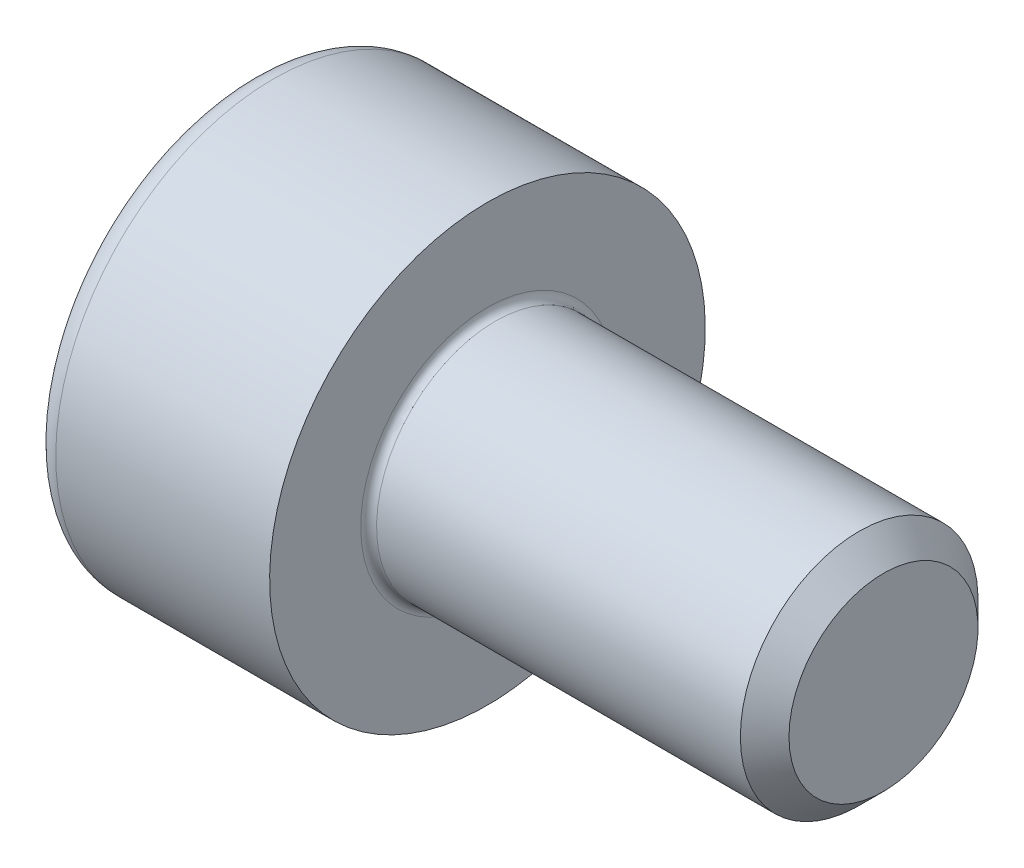
ISO-10303-21;
HEADER;
FILE_DESCRIPTION(('STEP AP214'),'2;1');
FILE_NAME('part.step','',(''),(''),'','','');
FILE_SCHEMA(('AUTOMOTIVE_DESIGN { 1 0 10303 214 1 1 1 1 }'));
ENDSEC;
DATA;
#1=APPLICATION_CONTEXT('core data for automotive mechanical design processes');
#2=APPLICATION_PROTOCOL_DEFINITION('international standard','automotive_design',2000,#1);
#3=PRODUCT_CONTEXT('',#1,'mechanical');
#4=PRODUCT('Part','Part','',(#3));
#5=PRODUCT_RELATED_PRODUCT_CATEGORY('part','',(#4));
#6=PRODUCT_DEFINITION_FORMATION('','',#4);
#7=PRODUCT_DEFINITION_CONTEXT('part definition',#1,'design');
#8=PRODUCT_DEFINITION('design','',#6,#7);
#9=PRODUCT_DEFINITION_SHAPE('','',#8);
#10=(LENGTH_UNIT() NAMED_UNIT(*) SI_UNIT(.MILLI.,.METRE.));
#11=(NAMED_UNIT(*) PLANE_ANGLE_UNIT() SI_UNIT($,.RADIAN.));
#12=(NAMED_UNIT(*) SI_UNIT($,.STERADIAN.) SOLID_ANGLE_UNIT());
#13=UNCERTAINTY_MEASURE_WITH_UNIT(LENGTH_MEASURE(1.E-05),#10,'distance_accuracy_value','');
#14=(GEOMETRIC_REPRESENTATION_CONTEXT(3) GLOBAL_UNCERTAINTY_ASSIGNED_CONTEXT((#13)) GLOBAL_UNIT_ASSIGNED_CONTEXT((#10,
#11,#12)) REPRESENTATION_CONTEXT('',''));
#15=CARTESIAN_POINT('',(0.,0.,0.));
#16=DIRECTION('',(0.,0.,1.));
#17=DIRECTION('',(1.,0.,0.));
#18=AXIS2_PLACEMENT_3D('',#15,#16,#17);
#19=CARTESIAN_POINT('',(5.,0.749999999999999,0.));
#20=DIRECTION('',(1.,0.,0.));
#21=DIRECTION('',(0.,1.,0.));
#22=AXIS2_PLACEMENT_3D('',#19,#20,#21);
#23=PLANE('',#22);
#24=CARTESIAN_POINT('',(4.99999999999545,0.,0.));
#25=DIRECTION('',(-1.,0.,0.));
#26=DIRECTION('',(0.,0.,1.));
#27=AXIS2_PLACEMENT_3D('',#24,#25,#26);
#28=CIRCLE('',#27,1.19327500004829);
#29=CARTESIAN_POINT('',(4.99999999999545,0.,1.19327500004829));
#30=VERTEX_POINT('',#29);
#31=EDGE_CURVE('E20',#30,#30,#28,.T.);
#32=ORIENTED_EDGE('',*,*,#31,.F.);
#33=EDGE_LOOP('',(#32));
#34=FACE_BOUND('',#33,.T.);
#35=ADVANCED_FACE('F17',(#34),#23,.T.);
#36=CARTESIAN_POINT('',(4.69327500002237,0.,0.));
#37=DIRECTION('',(-1.,0.,0.));
#38=DIRECTION('',(0.,0.,1.));
#39=AXIS2_PLACEMENT_3D('',#36,#37,#38);
#40=CONICAL_SURFACE('',#39,1.50000000002137,0.785398163397448);
#41=ORIENTED_EDGE('',*,*,#31,.T.);
#42=EDGE_LOOP('',(#41));
#43=FACE_BOUND('',#42,.T.);
#44=CARTESIAN_POINT('',(4.693275,0.,0.));
#45=DIRECTION('',(1.,0.,0.));
#46=DIRECTION('',(0.,1.,0.));
#47=AXIS2_PLACEMENT_3D('',#44,#45,#46);
#48=CIRCLE('',#47,1.5);
#49=CARTESIAN_POINT('',(4.693275,1.5,0.));
#50=VERTEX_POINT('',#49);
#51=EDGE_CURVE('E86',#50,#50,#48,.F.);
#52=ORIENTED_EDGE('',*,*,#51,.F.);
#53=EDGE_LOOP('',(#52));
#54=FACE_BOUND('',#53,.T.);
#55=ADVANCED_FACE('F76',(#43,#54),#40,.T.);
#56=CARTESIAN_POINT('',(-1.70499999995855,0.,0.));
#57=DIRECTION('',(-1.,0.,0.));
#58=DIRECTION('',(0.,0.,1.));
#59=AXIS2_PLACEMENT_3D('',#56,#57,#58);
#60=CONICAL_SURFACE('',#59,1.45203592694543,1.04719755110347);
#61=CARTESIAN_POINT('',(-0.866666666638594,-5.6843418860808E-11,0.));
#62=VERTEX_POINT('',#61);
#63=VERTEX_LOOP('',#62);
#64=FACE_BOUND('',#63,.T.);
#65=CARTESIAN_POINT('',(-1.69999999999617,1.25,0.721687836488135));
#66=CARTESIAN_POINT('',(-1.68168471569602,1.25,0.658260217058125));
#67=CARTESIAN_POINT('',(-1.66502792317553,1.25,0.594285091319299));
#68=CARTESIAN_POINT('',(-1.63595399210618,1.25,0.46522715333314));
#69=CARTESIAN_POINT('',(-1.62354713768941,1.25,0.400142048722467));
#70=CARTESIAN_POINT('',(-1.60423497431521,1.25,0.270778406576447));
#71=CARTESIAN_POINT('',(-1.5972011172206,1.25,0.206519767719932));
#72=CARTESIAN_POINT('',(-1.58880573005285,1.25,0.0777002896263008));
#73=CARTESIAN_POINT('',(-1.58743724620536,1.25,0.0131399182916871));
#74=CARTESIAN_POINT('',(-1.5902914313199,1.25,-0.107484209674466));
#75=CARTESIAN_POINT('',(-1.59381330323442,1.25,-0.163566066939126));
#76=CARTESIAN_POINT('',(-1.60497331292594,1.25,-0.275364426461755));
#77=CARTESIAN_POINT('',(-1.61261525920924,1.25,-0.331080542327663));
#78=CARTESIAN_POINT('',(-1.63171864581936,1.25,-0.443109217014378));
#79=CARTESIAN_POINT('',(-1.64326102637173,1.25,-0.499407604247212));
#80=CARTESIAN_POINT('',(-1.66945735051506,1.25,-0.611164931125642));
#81=CARTESIAN_POINT('',(-1.68410514296338,1.25,-0.66662530140732));
#82=CARTESIAN_POINT('',(-1.69999999999617,1.25,-0.721687836488137));
#83=B_SPLINE_CURVE_WITH_KNOTS('',3,(#65,#66,#67,#68,#69,#70,#71,#72,#73,#74,#75,#76,#77,#78,#79,
#80,#81,#82),.UNSPECIFIED.,.F.,.F.,(4,2,2,2,2,2,2,2,4),(0.,0.198135007230195,0.396746135656533,
0.590442253865266,0.783900555585791,0.952317364165593,1.12089012113824,1.29320101406964,
1.4651737334584),.UNSPECIFIED.);
#84=CARTESIAN_POINT('',(-1.69999999999617,1.25000000000048,0.721687836487309));
#85=VERTEX_POINT('',#84);
#86=CARTESIAN_POINT('',(-1.69999999999601,1.25,-0.721687836487585));
#87=VERTEX_POINT('',#86);
#88=EDGE_CURVE('E68',#85,#87,#83,.T.);
#89=ORIENTED_EDGE('',*,*,#88,.T.);
#90=CARTESIAN_POINT('',(-1.69999999999617,1.25000000000095,-0.721687836486483));
#91=CARTESIAN_POINT('',(-1.68168471569602,1.19507007027299,-0.753401646201488));
#92=CARTESIAN_POINT('',(-1.66502792317553,1.13966598617287,-0.785389209070901));
#93=CARTESIAN_POINT('',(-1.63595399210618,1.02789853331682,-0.84991817806398));
#94=CARTESIAN_POINT('',(-1.62354713768941,0.971533179316005,-0.882460730369317));
#95=CARTESIAN_POINT('',(-1.60423497431521,0.859500978891473,-0.947142551442327));
#96=CARTESIAN_POINT('',(-1.5972011172206,0.803851365229121,-0.979271870870584));
#97=CARTESIAN_POINT('',(-1.58880573005285,0.692290424697783,-1.0436816099174));
#98=CARTESIAN_POINT('',(-1.58743724620536,0.636379503044251,-1.07596179558471));
#99=CARTESIAN_POINT('',(-1.5902914313199,0.531915943916217,-1.13627385956778));
#100=CARTESIAN_POINT('',(-1.59381330323442,0.483347630833609,-1.16431478820011));
#101=CARTESIAN_POINT('',(-1.60497331292594,0.386527411385587,-1.22021396796143));
#102=CARTESIAN_POINT('',(-1.61261525920924,0.338275839645513,-1.24807202589438));
#103=CARTESIAN_POINT('',(-1.63171864581936,0.241256161414515,-1.30408636323774));
#104=CARTESIAN_POINT('',(-1.64326102637173,0.192500327878788,-1.33223555685416));
#105=CARTESIAN_POINT('',(-1.66945735051506,0.0957156437430261,-1.38811422029337));
#106=CARTESIAN_POINT('',(-1.68410514296338,0.0476855541758015,-1.41584440543421));
#107=CARTESIAN_POINT('',(-1.69999999999617,-9.57268631230381E-13,-1.44337567297462));
#108=B_SPLINE_CURVE_WITH_KNOTS('',3,(#90,#91,#92,#93,#94,#95,#96,#97,#98,#99,#100,#101,#102,
#103,#104,#105,#106,#107),.UNSPECIFIED.,.F.,.F.,(4,2,2,2,2,2,2,2,4),(0.,0.198135007230194,
0.396746135656533,0.590442253865266,0.78390055558579,0.952317364165593,1.12089012113824,
1.29320101406964,1.4651737334584),.UNSPECIFIED.);
#109=CARTESIAN_POINT('',(-1.69999999999617,0.,-1.44337567297462));
#110=VERTEX_POINT('',#109);
#111=EDGE_CURVE('E81',#87,#110,#108,.T.);
#112=ORIENTED_EDGE('',*,*,#111,.T.);
#113=CARTESIAN_POINT('',(-1.69999999999617,9.51335415999703E-13,-1.44337567297462));
#114=CARTESIAN_POINT('',(-1.68168471569602,-0.0549299297270088,-1.41166186325961));
#115=CARTESIAN_POINT('',(-1.66502792317554,-0.110334013827137,-1.3796743003902));
#116=CARTESIAN_POINT('',(-1.63595399210618,-0.222101466683187,-1.31514533139712));
#117=CARTESIAN_POINT('',(-1.62354713768941,-0.278466820683998,-1.28260277909179));
#118=CARTESIAN_POINT('',(-1.60423497431521,-0.39049902110853,-1.21792095801877));
#119=CARTESIAN_POINT('',(-1.5972011172206,-0.446148634770882,-1.18579163859052));
#120=CARTESIAN_POINT('',(-1.58880573005286,-0.55770957530222,-1.1213818995437));
#121=CARTESIAN_POINT('',(-1.58743724620536,-0.613620496955752,-1.08910171387639));
#122=CARTESIAN_POINT('',(-1.5902914313199,-0.718084056083786,-1.02878964989332));
#123=CARTESIAN_POINT('',(-1.59381330323442,-0.766652369166395,-1.00074872126099));
#124=CARTESIAN_POINT('',(-1.60497331292594,-0.863472588614416,-0.944849541499674));
#125=CARTESIAN_POINT('',(-1.61261525920924,-0.91172416035449,-0.91699148356672));
#126=CARTESIAN_POINT('',(-1.63171864581936,-1.00874383858549,-0.860977146223363));
#127=CARTESIAN_POINT('',(-1.64326102637173,-1.05749967212121,-0.832827952606947));
#128=CARTESIAN_POINT('',(-1.66945735051506,-1.15428435625698,-0.776949289167732));
#129=CARTESIAN_POINT('',(-1.68410514296338,-1.2023144458242,-0.749219104026893));
#130=CARTESIAN_POINT('',(-1.69999999999617,-1.25000000000096,-0.721687836486485));
#131=B_SPLINE_CURVE_WITH_KNOTS('',3,(#113,#114,#115,#116,#117,#118,#119,#120,#121,#122,#123,
#124,#125,#126,#127,#128,#129,#130),.UNSPECIFIED.,.F.,.F.,(4,2,2,2,2,2,2,2,4),(0.,
0.198135007230195,0.396746135656534,0.590442253865268,0.783900555585792,0.952317364165594,
1.12089012113824,1.29320101406964,1.4651737334584),.UNSPECIFIED.);
#132=CARTESIAN_POINT('',(-1.69999999999617,-1.25000000000048,-0.721687836487312));
#133=VERTEX_POINT('',#132);
#134=EDGE_CURVE('E108',#110,#133,#131,.T.);
#135=ORIENTED_EDGE('',*,*,#134,.T.);
#136=CARTESIAN_POINT('',(-1.69999999999617,-1.25,-0.721687836488139));
#137=CARTESIAN_POINT('',(-1.68168471569602,-1.25,-0.65826021705813));
#138=CARTESIAN_POINT('',(-1.66502792317553,-1.25,-0.594285091319303));
#139=CARTESIAN_POINT('',(-1.63595399210618,-1.25,-0.465227153333144));
#140=CARTESIAN_POINT('',(-1.62354713768941,-1.25,-0.400142048722471));
#141=CARTESIAN_POINT('',(-1.60423497431521,-1.25,-0.270778406576451));
#142=CARTESIAN_POINT('',(-1.5972011172206,-1.25,-0.206519767719936));
#143=CARTESIAN_POINT('',(-1.58880573005285,-1.25,-0.0777002896263046));
#144=CARTESIAN_POINT('',(-1.58743724620536,-1.25,-0.0131399182916908));
#145=CARTESIAN_POINT('',(-1.5902914313199,-1.25,0.107484209674463));
#146=CARTESIAN_POINT('',(-1.59381330323442,-1.25,0.163566066939124));
#147=CARTESIAN_POINT('',(-1.60497331292594,-1.25,0.275364426461753));
#148=CARTESIAN_POINT('',(-1.61261525920924,-1.25,0.331080542327662));
#149=CARTESIAN_POINT('',(-1.63171864581936,-1.25,0.443109217014378));
#150=CARTESIAN_POINT('',(-1.64326102637173,-1.25,0.499407604247211));
#151=CARTESIAN_POINT('',(-1.66945735051506,-1.25,0.611164931125643));
#152=CARTESIAN_POINT('',(-1.68410514296338,-1.25,0.666625301407321));
#153=CARTESIAN_POINT('',(-1.69999999999617,-1.25,0.721687836488138));
#154=B_SPLINE_CURVE_WITH_KNOTS('',3,(#136,#137,#138,#139,#140,#141,#142,#143,#144,#145,#146,
#147,#148,#149,#150,#151,#152,#153),.UNSPECIFIED.,.F.,.F.,(4,2,2,2,2,2,2,2,4),(0.,
0.198135007230195,0.396746135656533,0.590442253865267,0.783900555585792,0.952317364165596,
1.12089012113824,1.29320101406964,1.46517373345841),.UNSPECIFIED.);
#155=CARTESIAN_POINT('',(-1.69999999999617,-1.25000000000048,0.721687836487309));
#156=VERTEX_POINT('',#155);
#157=EDGE_CURVE('E130',#133,#156,#154,.T.);
#158=ORIENTED_EDGE('',*,*,#157,.T.);
#159=CARTESIAN_POINT('',(-1.69999999999617,-1.25000000000096,0.72168783648648));
#160=CARTESIAN_POINT('',(-1.68168471569602,-1.195070070273,0.753401646201485));
#161=CARTESIAN_POINT('',(-1.66502792317553,-1.13966598617287,0.785389209070899));
#162=CARTESIAN_POINT('',(-1.63595399210618,-1.02789853331682,0.849918178063978));
#163=CARTESIAN_POINT('',(-1.62354713768941,-0.971533179316009,0.882460730369314));
#164=CARTESIAN_POINT('',(-1.60423497431521,-0.859500978891477,0.947142551442324));
#165=CARTESIAN_POINT('',(-1.5972011172206,-0.803851365229124,0.979271870870582));
#166=CARTESIAN_POINT('',(-1.58880573005285,-0.692290424697787,1.0436816099174));
#167=CARTESIAN_POINT('',(-1.58743724620536,-0.636379503044255,1.0759617955847));
#168=CARTESIAN_POINT('',(-1.5902914313199,-0.531915943916221,1.13627385956778));
#169=CARTESIAN_POINT('',(-1.59381330323442,-0.483347630833612,1.16431478820011));
#170=CARTESIAN_POINT('',(-1.60497331292594,-0.38652741138559,1.22021396796143));
#171=CARTESIAN_POINT('',(-1.61261525920924,-0.338275839645515,1.24807202589438));
#172=CARTESIAN_POINT('',(-1.63171864581936,-0.241256161414517,1.30408636323774));
#173=CARTESIAN_POINT('',(-1.64326102637173,-0.19250032787879,1.33223555685415));
#174=CARTESIAN_POINT('',(-1.66945735051506,-0.0957156437430276,1.38811422029337));
#175=CARTESIAN_POINT('',(-1.68410514296338,-0.0476855541758027,1.41584440543421));
#176=CARTESIAN_POINT('',(-1.69999999999617,9.56251440187165E-13,1.44337567297462));
#177=B_SPLINE_CURVE_WITH_KNOTS('',3,(#159,#160,#161,#162,#163,#164,#165,#166,#167,#168,#169,
#170,#171,#172,#173,#174,#175,#176),.UNSPECIFIED.,.F.,.F.,(4,2,2,2,2,2,2,2,4),(0.,
0.198135007230195,0.396746135656533,0.590442253865267,0.783900555585791,0.952317364165594,
1.12089012113824,1.29320101406964,1.46517373345841),.UNSPECIFIED.);
#178=CARTESIAN_POINT('',(-1.69999999999617,0.,1.44337567297462));
#179=VERTEX_POINT('',#178);
#180=EDGE_CURVE('E135',#156,#179,#177,.T.);
#181=ORIENTED_EDGE('',*,*,#180,.T.);
#182=CARTESIAN_POINT('',(-1.69999999999617,-9.52687770426114E-13,1.44337567297462));
#183=CARTESIAN_POINT('',(-1.68168471569602,0.0549299297270073,1.41166186325962));
#184=CARTESIAN_POINT('',(-1.66502792317554,0.110334013827135,1.3796743003902));
#185=CARTESIAN_POINT('',(-1.63595399210618,0.222101466683186,1.31514533139712));
#186=CARTESIAN_POINT('',(-1.62354713768941,0.278466820683996,1.28260277909179));
#187=CARTESIAN_POINT('',(-1.60423497431521,0.390499021108529,1.21792095801878));
#188=CARTESIAN_POINT('',(-1.5972011172206,0.446148634770881,1.18579163859052));
#189=CARTESIAN_POINT('',(-1.58880573005286,0.557709575302219,1.1213818995437));
#190=CARTESIAN_POINT('',(-1.58743724620536,0.613620496955751,1.08910171387639));
#191=CARTESIAN_POINT('',(-1.5902914313199,0.718084056083784,1.02878964989332));
#192=CARTESIAN_POINT('',(-1.59381330323442,0.766652369166393,1.00074872126099));
#193=CARTESIAN_POINT('',(-1.60497331292594,0.863472588614414,0.944849541499674));
#194=CARTESIAN_POINT('',(-1.61261525920924,0.911724160354488,0.916991483566719));
#195=CARTESIAN_POINT('',(-1.63171864581936,1.00874383858549,0.860977146223362));
#196=CARTESIAN_POINT('',(-1.64326102637173,1.05749967212121,0.832827952606946));
#197=CARTESIAN_POINT('',(-1.66945735051506,1.15428435625697,0.776949289167731));
#198=CARTESIAN_POINT('',(-1.68410514296338,1.2023144458242,0.749219104026892));
#199=CARTESIAN_POINT('',(-1.69999999999617,1.25000000000096,0.721687836486483));
#200=B_SPLINE_CURVE_WITH_KNOTS('',3,(#182,#183,#184,#185,#186,#187,#188,#189,#190,#191,#192,
#193,#194,#195,#196,#197,#198,#199),.UNSPECIFIED.,.F.,.F.,(4,2,2,2,2,2,2,2,4),(0.,
0.198135007230195,0.396746135656534,0.590442253865268,0.783900555585793,0.952317364165595,
1.12089012113824,1.29320101406964,1.4651737334584),.UNSPECIFIED.);
#201=EDGE_CURVE('E83',#179,#85,#200,.T.);
#202=ORIENTED_EDGE('',*,*,#201,.T.);
#203=EDGE_LOOP('',(#89,#112,#135,#158,#181,#202));
#204=FACE_BOUND('',#203,.T.);
#205=ADVANCED_FACE('F72',(#64,#204),#60,.F.);
#206=CARTESIAN_POINT('',(3.125,0.,0.));
#207=DIRECTION('',(1.,0.,0.));
#208=DIRECTION('',(0.,1.,0.));
#209=AXIS2_PLACEMENT_3D('',#206,#207,#208);
#210=CYLINDRICAL_SURFACE('',#209,1.5);
#211=CARTESIAN_POINT('',(0.100000000000002,0.,0.));
#212=DIRECTION('',(1.,0.,0.));
#213=DIRECTION('',(0.,0.,-1.));
#214=AXIS2_PLACEMENT_3D('',#211,#212,#213);
#215=CIRCLE('',#214,1.5);
#216=CARTESIAN_POINT('',(0.100000000000002,0.,-1.5));
#217=VERTEX_POINT('',#216);
#218=EDGE_CURVE('E97',#217,#217,#215,.T.);
#219=ORIENTED_EDGE('',*,*,#218,.T.);
#220=EDGE_LOOP('',(#219));
#221=FACE_BOUND('',#220,.T.);
#222=ORIENTED_EDGE('',*,*,#51,.T.);
#223=EDGE_LOOP('',(#222));
#224=FACE_BOUND('',#223,.T.);
#225=ADVANCED_FACE('F75',(#221,#224),#210,.T.);
#226=CARTESIAN_POINT('',(-2.99999999999999,1.25,0.721687836487031));
#227=DIRECTION('',(0.,1.,0.));
#228=DIRECTION('',(0.,0.,1.));
#229=AXIS2_PLACEMENT_3D('',#226,#227,#228);
#230=PLANE('',#229);
#231=DIRECTION('',(1.,0.,0.));
#232=VECTOR('',#231,1.);
#233=CARTESIAN_POINT('',(-2.99999999999999,1.25,0.721687836487034));
#234=LINE('',#233,#232);
#235=CARTESIAN_POINT('',(-2.99999999999999,1.25,0.721687836487032));
#236=VERTEX_POINT('',#235);
#237=EDGE_CURVE('E85',#85,#236,#234,.F.);
#238=ORIENTED_EDGE('',*,*,#237,.T.);
#239=DIRECTION('',(0.,0.,1.));
#240=VECTOR('',#239,1.);
#241=CARTESIAN_POINT('',(-2.99999999999999,1.25,0.));
#242=LINE('',#241,#240);
#243=CARTESIAN_POINT('',(-2.99999999999999,1.25,-0.721687836487033));
#244=VERTEX_POINT('',#243);
#245=EDGE_CURVE('E92',#244,#236,#242,.T.);
#246=ORIENTED_EDGE('',*,*,#245,.F.);
#247=DIRECTION('',(1.,0.,0.));
#248=VECTOR('',#247,1.);
#249=CARTESIAN_POINT('',(-2.99999999999999,1.25,-0.721687836487033));
#250=LINE('',#249,#248);
#251=EDGE_CURVE('E89',#244,#87,#250,.T.);
#252=ORIENTED_EDGE('',*,*,#251,.T.);
#253=ORIENTED_EDGE('',*,*,#88,.F.);
#254=EDGE_LOOP('',(#238,#246,#252,#253));
#255=FACE_BOUND('',#254,.T.);
#256=ADVANCED_FACE('F90',(#255),#230,.F.);
#257=CARTESIAN_POINT('',(-2.99999999999999,0.,1.44337567297407));
#258=DIRECTION('',(0.,0.500000000000001,0.866025403784438));
#259=DIRECTION('',(0.,-0.866025403784438,0.500000000000001));
#260=AXIS2_PLACEMENT_3D('',#257,#258,#259);
#261=PLANE('',#260);
#262=DIRECTION('',(1.,0.,0.));
#263=VECTOR('',#262,1.);
#264=CARTESIAN_POINT('',(-2.99999999999999,0.,1.44337567297407));
#265=LINE('',#264,#263);
#266=CARTESIAN_POINT('',(-2.99999999999999,0.,1.44337567297407));
#267=VERTEX_POINT('',#266);
#268=EDGE_CURVE('E141',#179,#267,#265,.F.);
#269=ORIENTED_EDGE('',*,*,#268,.T.);
#270=DIRECTION('',(0.,-0.866025403784437,0.500000000000004));
#271=VECTOR('',#270,1.);
#272=CARTESIAN_POINT('',(-2.99999999999999,1.25,0.721687836487031));
#273=LINE('',#272,#271);
#274=EDGE_CURVE('E258',#236,#267,#273,.T.);
#275=ORIENTED_EDGE('',*,*,#274,.F.);
#276=ORIENTED_EDGE('',*,*,#237,.F.);
#277=ORIENTED_EDGE('',*,*,#201,.F.);
#278=EDGE_LOOP('',(#269,#275,#276,#277));
#279=FACE_BOUND('',#278,.T.);
#280=ADVANCED_FACE('F146',(#279),#261,.F.);
#281=CARTESIAN_POINT('',(-2.99999999999999,-1.25,0.721687836487033));
#282=DIRECTION('',(0.,-0.5,0.866025403784439));
#283=DIRECTION('',(0.,-0.866025403784439,-0.5));
#284=AXIS2_PLACEMENT_3D('',#281,#282,#283);
#285=PLANE('',#284);
#286=DIRECTION('',(1.,0.,0.));
#287=VECTOR('',#286,1.);
#288=CARTESIAN_POINT('',(-2.99999999999999,-1.25,0.721687836487033));
#289=LINE('',#288,#287);
#290=CARTESIAN_POINT('',(-2.99999999999999,-1.25,0.721687836487033));
#291=VERTEX_POINT('',#290);
#292=EDGE_CURVE('E140',#156,#291,#289,.F.);
#293=ORIENTED_EDGE('',*,*,#292,.T.);
#294=DIRECTION('',(0.,-0.866025403784437,-0.500000000000003));
#295=VECTOR('',#294,1.);
#296=CARTESIAN_POINT('',(-2.99999999999999,0.,1.44337567297407));
#297=LINE('',#296,#295);
#298=EDGE_CURVE('E273',#267,#291,#297,.T.);
#299=ORIENTED_EDGE('',*,*,#298,.F.);
#300=ORIENTED_EDGE('',*,*,#268,.F.);
#301=ORIENTED_EDGE('',*,*,#180,.F.);
#302=EDGE_LOOP('',(#293,#299,#300,#301));
#303=FACE_BOUND('',#302,.T.);
#304=ADVANCED_FACE('F142',(#303),#285,.F.);
#305=CARTESIAN_POINT('',(-2.99999999999999,-1.25,-0.721687836487032));
#306=DIRECTION('',(0.,-1.,0.));
#307=DIRECTION('',(1.,0.,0.));
#308=AXIS2_PLACEMENT_3D('',#305,#306,#307);
#309=PLANE('',#308);
#310=DIRECTION('',(1.,0.,0.));
#311=VECTOR('',#310,1.);
#312=CARTESIAN_POINT('',(-2.99999999999999,-1.25,-0.721687836487037));
#313=LINE('',#312,#311);
#314=CARTESIAN_POINT('',(-2.99999999999999,-1.25,-0.721687836487034));
#315=VERTEX_POINT('',#314);
#316=EDGE_CURVE('E240',#133,#315,#313,.F.);
#317=ORIENTED_EDGE('',*,*,#316,.T.);
#318=DIRECTION('',(0.,0.,1.));
#319=VECTOR('',#318,1.);
#320=CARTESIAN_POINT('',(-2.99999999999999,-1.25,0.));
#321=LINE('',#320,#319);
#322=EDGE_CURVE('E268',#291,#315,#321,.F.);
#323=ORIENTED_EDGE('',*,*,#322,.F.);
#324=ORIENTED_EDGE('',*,*,#292,.F.);
#325=ORIENTED_EDGE('',*,*,#157,.F.);
#326=EDGE_LOOP('',(#317,#323,#324,#325));
#327=FACE_BOUND('',#326,.T.);
#328=ADVANCED_FACE('F145',(#327),#309,.F.);
#329=CARTESIAN_POINT('',(-2.99999999999999,0.,-1.44337567297407));
#330=DIRECTION('',(0.,-0.5,-0.866025403784439));
#331=DIRECTION('',(0.,0.866025403784439,-0.5));
#332=AXIS2_PLACEMENT_3D('',#329,#330,#331);
#333=PLANE('',#332);
#334=DIRECTION('',(1.,0.,0.));
#335=VECTOR('',#334,1.);
#336=CARTESIAN_POINT('',(-2.99999999999999,0.,-1.44337567297407));
#337=LINE('',#336,#335);
#338=CARTESIAN_POINT('',(-2.99999999999999,0.,-1.44337567297407));
#339=VERTEX_POINT('',#338);
#340=EDGE_CURVE('E35',#110,#339,#337,.F.);
#341=ORIENTED_EDGE('',*,*,#340,.T.);
#342=DIRECTION('',(0.,0.866025403784437,-0.500000000000003));
#343=VECTOR('',#342,1.);
#344=CARTESIAN_POINT('',(-2.99999999999999,-1.25,-0.721687836487032));
#345=LINE('',#344,#343);
#346=EDGE_CURVE('E263',#315,#339,#345,.T.);
#347=ORIENTED_EDGE('',*,*,#346,.F.);
#348=ORIENTED_EDGE('',*,*,#316,.F.);
#349=ORIENTED_EDGE('',*,*,#134,.F.);
#350=EDGE_LOOP('',(#341,#347,#348,#349));
#351=FACE_BOUND('',#350,.T.);
#352=ADVANCED_FACE('F290',(#351),#333,.F.);
#353=CARTESIAN_POINT('',(-2.99999999999999,1.25,-0.721687836487033));
#354=DIRECTION('',(0.,0.5,-0.866025403784439));
#355=DIRECTION('',(0.,0.866025403784439,0.5));
#356=AXIS2_PLACEMENT_3D('',#353,#354,#355);
#357=PLANE('',#356);
#358=ORIENTED_EDGE('',*,*,#251,.F.);
#359=DIRECTION('',(0.,0.866025403784437,0.500000000000002));
#360=VECTOR('',#359,1.);
#361=CARTESIAN_POINT('',(-2.99999999999999,0.,-1.44337567297407));
#362=LINE('',#361,#360);
#363=EDGE_CURVE('E261',#339,#244,#362,.T.);
#364=ORIENTED_EDGE('',*,*,#363,.F.);
#365=ORIENTED_EDGE('',*,*,#340,.F.);
#366=ORIENTED_EDGE('',*,*,#111,.F.);
#367=EDGE_LOOP('',(#358,#364,#365,#366));
#368=FACE_BOUND('',#367,.T.);
#369=ADVANCED_FACE('F96',(#368),#357,.F.);
#370=CARTESIAN_POINT('',(0.100000000000002,0.,0.));
#371=DIRECTION('',(1.,0.,0.));
#372=DIRECTION('',(0.,0.,-1.));
#373=AXIS2_PLACEMENT_3D('',#370,#371,#372);
#374=TOROIDAL_SURFACE('',#373,1.6,0.1);
#375=ORIENTED_EDGE('',*,*,#218,.F.);
#376=EDGE_LOOP('',(#375));
#377=FACE_BOUND('',#376,.T.);
#378=CARTESIAN_POINT('',(0.,0.,0.));
#379=DIRECTION('',(1.,0.,0.));
#380=DIRECTION('',(0.,1.,0.));
#381=AXIS2_PLACEMENT_3D('',#378,#379,#380);
#382=CIRCLE('',#381,1.6);
#383=CARTESIAN_POINT('',(0.,1.6,0.));
#384=VERTEX_POINT('',#383);
#385=EDGE_CURVE('E188',#384,#384,#382,.F.);
#386=ORIENTED_EDGE('',*,*,#385,.F.);
#387=EDGE_LOOP('',(#386));
#388=FACE_BOUND('',#387,.T.);
#389=ADVANCED_FACE('F213',(#377,#388),#374,.F.);
#390=CARTESIAN_POINT('',(-2.99999999999999,2.09668783648703,0.));
#391=DIRECTION('',(-1.,0.,0.));
#392=DIRECTION('',(0.,-1.,0.));
#393=AXIS2_PLACEMENT_3D('',#390,#391,#392);
#394=PLANE('',#393);
#395=ORIENTED_EDGE('',*,*,#346,.T.);
#396=ORIENTED_EDGE('',*,*,#363,.T.);
#397=ORIENTED_EDGE('',*,*,#245,.T.);
#398=ORIENTED_EDGE('',*,*,#274,.T.);
#399=ORIENTED_EDGE('',*,*,#298,.T.);
#400=ORIENTED_EDGE('',*,*,#322,.T.);
#401=EDGE_LOOP('',(#395,#396,#397,#398,#399,#400));
#402=FACE_BOUND('',#401,.T.);
#403=CARTESIAN_POINT('',(-2.99999999999999,0.,0.));
#404=DIRECTION('',(1.,0.,0.));
#405=DIRECTION('',(0.,1.,0.));
#406=AXIS2_PLACEMENT_3D('',#403,#404,#405);
#407=CIRCLE('',#406,2.45);
#408=CARTESIAN_POINT('',(-2.99999999999999,2.45,0.));
#409=VERTEX_POINT('',#408);
#410=EDGE_CURVE('E201',#409,#409,#407,.T.);
#411=ORIENTED_EDGE('',*,*,#410,.F.);
#412=EDGE_LOOP('',(#411));
#413=FACE_BOUND('',#412,.T.);
#414=ADVANCED_FACE('F205',(#402,#413),#394,.T.);
#415=CARTESIAN_POINT('',(0.,2.125,0.));
#416=DIRECTION('',(1.,0.,0.));
#417=DIRECTION('',(0.,1.,0.));
#418=AXIS2_PLACEMENT_3D('',#415,#416,#417);
#419=PLANE('',#418);
#420=ORIENTED_EDGE('',*,*,#385,.T.);
#421=EDGE_LOOP('',(#420));
#422=FACE_BOUND('',#421,.T.);
#423=CARTESIAN_POINT('',(0.,0.,0.));
#424=DIRECTION('',(1.,0.,0.));
#425=DIRECTION('',(0.,1.,0.));
#426=AXIS2_PLACEMENT_3D('',#423,#424,#425);
#427=CIRCLE('',#426,2.75);
#428=CARTESIAN_POINT('',(0.,2.75,0.));
#429=VERTEX_POINT('',#428);
#430=EDGE_CURVE('E26',#429,#429,#427,.F.);
#431=ORIENTED_EDGE('',*,*,#430,.F.);
#432=EDGE_LOOP('',(#431));
#433=FACE_BOUND('',#432,.T.);
#434=ADVANCED_FACE('F170',(#422,#433),#419,.T.);
#435=CARTESIAN_POINT('',(-2.69999999999999,0.,0.));
#436=DIRECTION('',(1.,0.,0.));
#437=DIRECTION('',(0.,0.,-1.));
#438=AXIS2_PLACEMENT_3D('',#435,#436,#437);
#439=TOROIDAL_SURFACE('',#438,2.45,0.3);
#440=CARTESIAN_POINT('',(-2.69999999999999,0.,0.));
#441=DIRECTION('',(1.,0.,0.));
#442=DIRECTION('',(0.,1.,0.));
#443=AXIS2_PLACEMENT_3D('',#440,#441,#442);
#444=CIRCLE('',#443,2.75);
#445=CARTESIAN_POINT('',(-2.69999999999999,2.75,0.));
#446=VERTEX_POINT('',#445);
#447=EDGE_CURVE('E11',#446,#446,#444,.T.);
#448=ORIENTED_EDGE('',*,*,#447,.F.);
#449=EDGE_LOOP('',(#448));
#450=FACE_BOUND('',#449,.T.);
#451=ORIENTED_EDGE('',*,*,#410,.T.);
#452=EDGE_LOOP('',(#451));
#453=FACE_BOUND('',#452,.T.);
#454=ADVANCED_FACE('F164',(#450,#453),#439,.T.);
#455=CARTESIAN_POINT('',(-1.5,0.,0.));
#456=DIRECTION('',(1.,0.,0.));
#457=DIRECTION('',(0.,1.,0.));
#458=AXIS2_PLACEMENT_3D('',#455,#456,#457);
#459=CYLINDRICAL_SURFACE('',#458,2.75);
#460=ORIENTED_EDGE('',*,*,#447,.T.);
#461=EDGE_LOOP('',(#460));
#462=FACE_BOUND('',#461,.T.);
#463=ORIENTED_EDGE('',*,*,#430,.T.);
#464=EDGE_LOOP('',(#463));
#465=FACE_BOUND('',#464,.T.);
#466=ADVANCED_FACE('F162',(#462,#465),#459,.T.);
#467=CLOSED_SHELL('',(#35,#55,#205,#225,#256,#280,#304,#328,#352,#369,#389,#414,#434,#454,#466));
#468=MANIFOLD_SOLID_BREP('B1',#467);
#469=ADVANCED_BREP_SHAPE_REPRESENTATION('',(#18,#468),#14);
#470=SHAPE_DEFINITION_REPRESENTATION(#9,#469);
ENDSEC;
END-ISO-10303-21;
